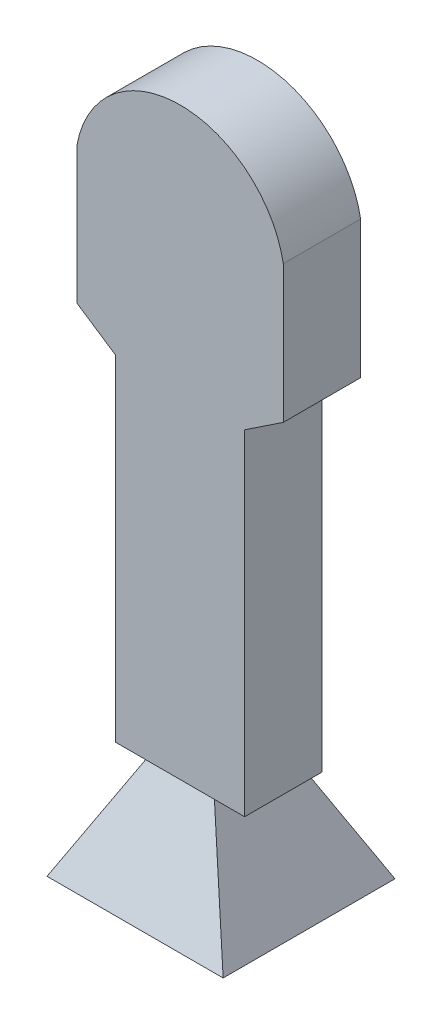
ISO-10303-21;
HEADER;
FILE_DESCRIPTION(('STEP AP214'),'2;1');
FILE_NAME('part.step','',(''),(''),'','','');
FILE_SCHEMA(('AUTOMOTIVE_DESIGN { 1 0 10303 214 1 1 1 1 }'));
ENDSEC;
DATA;
#1=APPLICATION_CONTEXT('core data for automotive mechanical design processes');
#2=APPLICATION_PROTOCOL_DEFINITION('international standard','automotive_design',2000,#1);
#3=PRODUCT_CONTEXT('',#1,'mechanical');
#4=PRODUCT('Part','Part','',(#3));
#5=PRODUCT_RELATED_PRODUCT_CATEGORY('part','',(#4));
#6=PRODUCT_DEFINITION_FORMATION('','',#4);
#7=PRODUCT_DEFINITION_CONTEXT('part definition',#1,'design');
#8=PRODUCT_DEFINITION('design','',#6,#7);
#9=PRODUCT_DEFINITION_SHAPE('','',#8);
#10=(LENGTH_UNIT() NAMED_UNIT(*) SI_UNIT(.MILLI.,.METRE.));
#11=(NAMED_UNIT(*) PLANE_ANGLE_UNIT() SI_UNIT($,.RADIAN.));
#12=(NAMED_UNIT(*) SI_UNIT($,.STERADIAN.) SOLID_ANGLE_UNIT());
#13=UNCERTAINTY_MEASURE_WITH_UNIT(LENGTH_MEASURE(1.E-05),#10,'distance_accuracy_value','');
#14=(GEOMETRIC_REPRESENTATION_CONTEXT(3) GLOBAL_UNCERTAINTY_ASSIGNED_CONTEXT((#13)) GLOBAL_UNIT_ASSIGNED_CONTEXT((#10,
#11,#12)) REPRESENTATION_CONTEXT('',''));
#15=CARTESIAN_POINT('',(0.,0.,0.));
#16=DIRECTION('',(0.,0.,1.));
#17=DIRECTION('',(1.,0.,0.));
#18=AXIS2_PLACEMENT_3D('',#15,#16,#17);
#19=CARTESIAN_POINT('',(-10.,-57.,4.5));
#20=DIRECTION('',(0.,1.,0.));
#21=DIRECTION('',(0.,0.,1.));
#22=AXIS2_PLACEMENT_3D('',#19,#20,#21);
#23=PLANE('',#22);
#24=DIRECTION('',(0.,0.,1.));
#25=VECTOR('',#24,1.);
#26=CARTESIAN_POINT('',(-3.,-57.,3.5));
#27=LINE('',#26,#25);
#28=CARTESIAN_POINT('',(-3.,-57.,-3.5));
#29=VERTEX_POINT('',#28);
#30=CARTESIAN_POINT('',(-3.,-57.,3.5));
#31=VERTEX_POINT('',#30);
#32=EDGE_CURVE('E383',#29,#31,#27,.T.);
#33=ORIENTED_EDGE('',*,*,#32,.T.);
#34=DIRECTION('',(1.,0.,0.));
#35=VECTOR('',#34,1.);
#36=CARTESIAN_POINT('',(0.,-57.,3.5));
#37=LINE('',#36,#35);
#38=CARTESIAN_POINT('',(3.,-57.,3.5));
#39=VERTEX_POINT('',#38);
#40=EDGE_CURVE('E381',#31,#39,#37,.T.);
#41=ORIENTED_EDGE('',*,*,#40,.T.);
#42=DIRECTION('',(0.,0.,-1.));
#43=VECTOR('',#42,1.);
#44=CARTESIAN_POINT('',(3.,-57.,3.5));
#45=LINE('',#44,#43);
#46=CARTESIAN_POINT('',(3.,-57.,-3.5));
#47=VERTEX_POINT('',#46);
#48=EDGE_CURVE('E385',#39,#47,#45,.T.);
#49=ORIENTED_EDGE('',*,*,#48,.T.);
#50=DIRECTION('',(1.,0.,0.));
#51=VECTOR('',#50,1.);
#52=CARTESIAN_POINT('',(0.,-57.,-3.5));
#53=LINE('',#52,#51);
#54=EDGE_CURVE('E220',#29,#47,#53,.T.);
#55=ORIENTED_EDGE('',*,*,#54,.F.);
#56=EDGE_LOOP('',(#33,#41,#49,#55));
#57=FACE_BOUND('',#56,.T.);
#58=DIRECTION('',(1.,0.,0.));
#59=VECTOR('',#58,1.);
#60=CARTESIAN_POINT('',(-10.,-57.,-1.66283647761011));
#61=LINE('',#60,#59);
#62=CARTESIAN_POINT('',(-1.51061217973868,-57.,-1.66283647761011));
#63=VERTEX_POINT('',#62);
#64=CARTESIAN_POINT('',(1.51061217973868,-57.,-1.66283647761011));
#65=VERTEX_POINT('',#64);
#66=EDGE_CURVE('E215',#63,#65,#61,.T.);
#67=ORIENTED_EDGE('',*,*,#66,.T.);
#68=DIRECTION('',(0.,0.,1.));
#69=VECTOR('',#68,1.);
#70=CARTESIAN_POINT('',(1.51061217973868,-57.,4.5));
#71=LINE('',#70,#69);
#72=CARTESIAN_POINT('',(1.51061217973868,-57.,1.66283647761011));
#73=VERTEX_POINT('',#72);
#74=EDGE_CURVE('E11',#65,#73,#71,.T.);
#75=ORIENTED_EDGE('',*,*,#74,.T.);
#76=DIRECTION('',(-1.,0.,0.));
#77=VECTOR('',#76,1.);
#78=CARTESIAN_POINT('',(-10.,-57.,1.66283647761011));
#79=LINE('',#78,#77);
#80=CARTESIAN_POINT('',(-1.51061217973868,-57.,1.66283647761011));
#81=VERTEX_POINT('',#80);
#82=EDGE_CURVE('E41',#73,#81,#79,.T.);
#83=ORIENTED_EDGE('',*,*,#82,.T.);
#84=DIRECTION('',(0.,0.,-1.));
#85=VECTOR('',#84,1.);
#86=CARTESIAN_POINT('',(-1.51061217973868,-57.,4.5));
#87=LINE('',#86,#85);
#88=EDGE_CURVE('E219',#81,#63,#87,.T.);
#89=ORIENTED_EDGE('',*,*,#88,.T.);
#90=EDGE_LOOP('',(#67,#75,#83,#89));
#91=FACE_BOUND('',#90,.T.);
#92=ADVANCED_FACE('F33',(#57,#91),#23,.T.);
#93=CARTESIAN_POINT('',(-11.,-14.,3.5));
#94=DIRECTION('',(0.571637687854966,0.820506157090749,0.));
#95=DIRECTION('',(-0.820506157090749,0.571637687854966,0.));
#96=AXIS2_PLACEMENT_3D('',#93,#94,#95);
#97=PLANE('',#96);
#98=DIRECTION('',(0.,0.,-1.));
#99=VECTOR('',#98,1.);
#100=CARTESIAN_POINT('',(-11.,-14.,3.5));
#101=LINE('',#100,#99);
#102=CARTESIAN_POINT('',(-11.,-14.,3.5));
#103=VERTEX_POINT('',#102);
#104=CARTESIAN_POINT('',(-11.,-14.,-3.5));
#105=VERTEX_POINT('',#104);
#106=EDGE_CURVE('E323',#103,#105,#101,.T.);
#107=ORIENTED_EDGE('',*,*,#106,.F.);
#108=DIRECTION('',(0.820506157090749,-0.571637687854966,0.));
#109=VECTOR('',#108,1.);
#110=CARTESIAN_POINT('',(-11.,-14.,3.5));
#111=LINE('',#110,#109);
#112=CARTESIAN_POINT('',(-6.5,-17.1351009046271,3.5));
#113=VERTEX_POINT('',#112);
#114=EDGE_CURVE('E346',#103,#113,#111,.T.);
#115=ORIENTED_EDGE('',*,*,#114,.T.);
#116=DIRECTION('',(0.,0.,-1.));
#117=VECTOR('',#116,1.);
#118=CARTESIAN_POINT('',(-6.5,-17.1351009046271,3.5));
#119=LINE('',#118,#117);
#120=CARTESIAN_POINT('',(-6.5,-17.1351009046271,-3.5));
#121=VERTEX_POINT('',#120);
#122=EDGE_CURVE('E304',#113,#121,#119,.T.);
#123=ORIENTED_EDGE('',*,*,#122,.T.);
#124=DIRECTION('',(0.820506157090749,-0.571637687854966,0.));
#125=VECTOR('',#124,1.);
#126=CARTESIAN_POINT('',(-11.,-14.,-3.5));
#127=LINE('',#126,#125);
#128=EDGE_CURVE('E378',#105,#121,#127,.T.);
#129=ORIENTED_EDGE('',*,*,#128,.F.);
#130=EDGE_LOOP('',(#107,#115,#123,#129));
#131=FACE_BOUND('',#130,.T.);
#132=ADVANCED_FACE('F453',(#131),#97,.T.);
#133=CARTESIAN_POINT('',(-6.5,-56.1094421952284,3.5));
#134=DIRECTION('',(1.,0.,0.));
#135=DIRECTION('',(0.,0.,-1.));
#136=AXIS2_PLACEMENT_3D('',#133,#134,#135);
#137=PLANE('',#136);
#138=ORIENTED_EDGE('',*,*,#122,.F.);
#139=DIRECTION('',(0.,-1.,0.));
#140=VECTOR('',#139,1.);
#141=CARTESIAN_POINT('',(-6.5,-56.1094421952284,3.5));
#142=LINE('',#141,#140);
#143=CARTESIAN_POINT('',(-6.5,-56.1094421952284,3.5));
#144=VERTEX_POINT('',#143);
#145=EDGE_CURVE('E344',#113,#144,#142,.T.);
#146=ORIENTED_EDGE('',*,*,#145,.T.);
#147=DIRECTION('',(0.,0.,-1.));
#148=VECTOR('',#147,1.);
#149=CARTESIAN_POINT('',(-6.5,-56.1094421952284,3.5));
#150=LINE('',#149,#148);
#151=CARTESIAN_POINT('',(-6.5,-56.1094421952284,-3.5));
#152=VERTEX_POINT('',#151);
#153=EDGE_CURVE('E306',#144,#152,#150,.T.);
#154=ORIENTED_EDGE('',*,*,#153,.T.);
#155=DIRECTION('',(0.,-1.,0.));
#156=VECTOR('',#155,1.);
#157=CARTESIAN_POINT('',(-6.5,-56.1094421952284,-3.5));
#158=LINE('',#157,#156);
#159=EDGE_CURVE('E375',#121,#152,#158,.T.);
#160=ORIENTED_EDGE('',*,*,#159,.F.);
#161=EDGE_LOOP('',(#138,#146,#154,#160));
#162=FACE_BOUND('',#161,.T.);
#163=ADVANCED_FACE('F460',(#162),#137,.T.);
#164=CARTESIAN_POINT('',(-6.5,-56.1094421952284,3.5));
#165=DIRECTION('',(0.,1.,0.));
#166=DIRECTION('',(0.,0.,1.));
#167=AXIS2_PLACEMENT_3D('',#164,#165,#166);
#168=PLANE('',#167);
#169=ORIENTED_EDGE('',*,*,#153,.F.);
#170=DIRECTION('',(1.,0.,0.));
#171=VECTOR('',#170,1.);
#172=CARTESIAN_POINT('',(-6.5,-56.1094421952284,3.5));
#173=LINE('',#172,#171);
#174=CARTESIAN_POINT('',(-3.,-56.1094421952284,3.5));
#175=VERTEX_POINT('',#174);
#176=EDGE_CURVE('E342',#144,#175,#173,.T.);
#177=ORIENTED_EDGE('',*,*,#176,.T.);
#178=DIRECTION('',(0.,0.,-1.));
#179=VECTOR('',#178,1.);
#180=CARTESIAN_POINT('',(-3.,-56.1094421952284,3.5));
#181=LINE('',#180,#179);
#182=CARTESIAN_POINT('',(-3.,-56.1094421952284,-3.5));
#183=VERTEX_POINT('',#182);
#184=EDGE_CURVE('E308',#175,#183,#181,.T.);
#185=ORIENTED_EDGE('',*,*,#184,.T.);
#186=DIRECTION('',(1.,0.,0.));
#187=VECTOR('',#186,1.);
#188=CARTESIAN_POINT('',(-6.5,-56.1094421952284,-3.5));
#189=LINE('',#188,#187);
#190=EDGE_CURVE('E372',#152,#183,#189,.T.);
#191=ORIENTED_EDGE('',*,*,#190,.F.);
#192=EDGE_LOOP('',(#169,#177,#185,#191));
#193=FACE_BOUND('',#192,.T.);
#194=ADVANCED_FACE('F505',(#193),#168,.T.);
#195=CARTESIAN_POINT('',(-3.,-57.0637363629491,3.5));
#196=DIRECTION('',(1.,0.,0.));
#197=DIRECTION('',(0.,0.,-1.));
#198=AXIS2_PLACEMENT_3D('',#195,#196,#197);
#199=PLANE('',#198);
#200=ORIENTED_EDGE('',*,*,#32,.F.);
#201=DIRECTION('',(0.,-1.,0.));
#202=VECTOR('',#201,1.);
#203=CARTESIAN_POINT('',(-3.,-57.0637363629491,-3.5));
#204=LINE('',#203,#202);
#205=EDGE_CURVE('E369',#183,#29,#204,.T.);
#206=ORIENTED_EDGE('',*,*,#205,.F.);
#207=ORIENTED_EDGE('',*,*,#184,.F.);
#208=DIRECTION('',(0.,-1.,0.));
#209=VECTOR('',#208,1.);
#210=CARTESIAN_POINT('',(-3.,-57.0637363629491,3.5));
#211=LINE('',#210,#209);
#212=EDGE_CURVE('E339',#175,#31,#211,.T.);
#213=ORIENTED_EDGE('',*,*,#212,.T.);
#214=EDGE_LOOP('',(#200,#206,#207,#213));
#215=FACE_BOUND('',#214,.T.);
#216=ADVANCED_FACE('F501',(#215),#199,.T.);
#217=CARTESIAN_POINT('',(3.,-57.0637363629491,3.5));
#218=DIRECTION('',(-1.,0.,0.));
#219=DIRECTION('',(0.,-1.,0.));
#220=AXIS2_PLACEMENT_3D('',#217,#218,#219);
#221=PLANE('',#220);
#222=ORIENTED_EDGE('',*,*,#48,.F.);
#223=DIRECTION('',(0.,1.,0.));
#224=VECTOR('',#223,1.);
#225=CARTESIAN_POINT('',(3.,-57.0637363629491,3.5));
#226=LINE('',#225,#224);
#227=CARTESIAN_POINT('',(3.,-56.1094421952284,3.5));
#228=VERTEX_POINT('',#227);
#229=EDGE_CURVE('E337',#39,#228,#226,.T.);
#230=ORIENTED_EDGE('',*,*,#229,.T.);
#231=DIRECTION('',(0.,0.,-1.));
#232=VECTOR('',#231,1.);
#233=CARTESIAN_POINT('',(3.,-56.1094421952284,3.5));
#234=LINE('',#233,#232);
#235=CARTESIAN_POINT('',(3.,-56.1094421952284,-3.5));
#236=VERTEX_POINT('',#235);
#237=EDGE_CURVE('E310',#228,#236,#234,.T.);
#238=ORIENTED_EDGE('',*,*,#237,.T.);
#239=DIRECTION('',(0.,1.,0.));
#240=VECTOR('',#239,1.);
#241=CARTESIAN_POINT('',(3.,-57.0637363629491,-3.5));
#242=LINE('',#241,#240);
#243=EDGE_CURVE('E367',#47,#236,#242,.T.);
#244=ORIENTED_EDGE('',*,*,#243,.F.);
#245=EDGE_LOOP('',(#222,#230,#238,#244));
#246=FACE_BOUND('',#245,.T.);
#247=ADVANCED_FACE('F497',(#246),#221,.T.);
#248=CARTESIAN_POINT('',(3.,-56.1094421952284,3.5));
#249=DIRECTION('',(0.,1.,0.));
#250=DIRECTION('',(0.,0.,1.));
#251=AXIS2_PLACEMENT_3D('',#248,#249,#250);
#252=PLANE('',#251);
#253=ORIENTED_EDGE('',*,*,#237,.F.);
#254=DIRECTION('',(1.,0.,0.));
#255=VECTOR('',#254,1.);
#256=CARTESIAN_POINT('',(3.,-56.1094421952284,3.5));
#257=LINE('',#256,#255);
#258=CARTESIAN_POINT('',(6.5,-56.1094421952284,3.5));
#259=VERTEX_POINT('',#258);
#260=EDGE_CURVE('E335',#228,#259,#257,.T.);
#261=ORIENTED_EDGE('',*,*,#260,.T.);
#262=DIRECTION('',(0.,0.,-1.));
#263=VECTOR('',#262,1.);
#264=CARTESIAN_POINT('',(6.5,-56.1094421952284,3.5));
#265=LINE('',#264,#263);
#266=CARTESIAN_POINT('',(6.5,-56.1094421952284,-3.5));
#267=VERTEX_POINT('',#266);
#268=EDGE_CURVE('E313',#259,#267,#265,.T.);
#269=ORIENTED_EDGE('',*,*,#268,.T.);
#270=DIRECTION('',(1.,0.,0.));
#271=VECTOR('',#270,1.);
#272=CARTESIAN_POINT('',(3.,-56.1094421952284,-3.5));
#273=LINE('',#272,#271);
#274=EDGE_CURVE('E364',#236,#267,#273,.T.);
#275=ORIENTED_EDGE('',*,*,#274,.F.);
#276=EDGE_LOOP('',(#253,#261,#269,#275));
#277=FACE_BOUND('',#276,.T.);
#278=ADVANCED_FACE('F493',(#277),#252,.T.);
#279=CARTESIAN_POINT('',(6.5,-56.1094421952284,3.5));
#280=DIRECTION('',(-1.,0.,0.));
#281=DIRECTION('',(0.,0.,1.));
#282=AXIS2_PLACEMENT_3D('',#279,#280,#281);
#283=PLANE('',#282);
#284=ORIENTED_EDGE('',*,*,#268,.F.);
#285=DIRECTION('',(0.,1.,0.));
#286=VECTOR('',#285,1.);
#287=CARTESIAN_POINT('',(6.5,-56.1094421952284,3.5));
#288=LINE('',#287,#286);
#289=CARTESIAN_POINT('',(6.5,-17.1351009046271,3.5));
#290=VERTEX_POINT('',#289);
#291=EDGE_CURVE('E333',#259,#290,#288,.T.);
#292=ORIENTED_EDGE('',*,*,#291,.T.);
#293=DIRECTION('',(0.,0.,-1.));
#294=VECTOR('',#293,1.);
#295=CARTESIAN_POINT('',(6.5,-17.1351009046271,3.5));
#296=LINE('',#295,#294);
#297=CARTESIAN_POINT('',(6.5,-17.1351009046271,-3.5));
#298=VERTEX_POINT('',#297);
#299=EDGE_CURVE('E315',#290,#298,#296,.T.);
#300=ORIENTED_EDGE('',*,*,#299,.T.);
#301=DIRECTION('',(0.,1.,0.));
#302=VECTOR('',#301,1.);
#303=CARTESIAN_POINT('',(6.5,-56.1094421952284,-3.5));
#304=LINE('',#303,#302);
#305=EDGE_CURVE('E361',#267,#298,#304,.T.);
#306=ORIENTED_EDGE('',*,*,#305,.F.);
#307=EDGE_LOOP('',(#284,#292,#300,#306));
#308=FACE_BOUND('',#307,.T.);
#309=ADVANCED_FACE('F489',(#308),#283,.T.);
#310=CARTESIAN_POINT('',(11.,-14.,3.5));
#311=DIRECTION('',(-0.571637687854965,0.82050615709075,0.));
#312=DIRECTION('',(-0.82050615709075,-0.571637687854965,0.));
#313=AXIS2_PLACEMENT_3D('',#310,#311,#312);
#314=PLANE('',#313);
#315=ORIENTED_EDGE('',*,*,#299,.F.);
#316=DIRECTION('',(0.82050615709075,0.571637687854965,0.));
#317=VECTOR('',#316,1.);
#318=CARTESIAN_POINT('',(11.,-14.,3.5));
#319=LINE('',#318,#317);
#320=CARTESIAN_POINT('',(11.,-14.,3.5));
#321=VERTEX_POINT('',#320);
#322=EDGE_CURVE('E331',#290,#321,#319,.T.);
#323=ORIENTED_EDGE('',*,*,#322,.T.);
#324=DIRECTION('',(0.,0.,-1.));
#325=VECTOR('',#324,1.);
#326=CARTESIAN_POINT('',(11.,-14.,3.5));
#327=LINE('',#326,#325);
#328=CARTESIAN_POINT('',(11.,-14.,-3.5));
#329=VERTEX_POINT('',#328);
#330=EDGE_CURVE('E317',#321,#329,#327,.T.);
#331=ORIENTED_EDGE('',*,*,#330,.T.);
#332=DIRECTION('',(0.82050615709075,0.571637687854965,0.));
#333=VECTOR('',#332,1.);
#334=CARTESIAN_POINT('',(11.,-14.,-3.5));
#335=LINE('',#334,#333);
#336=EDGE_CURVE('E358',#298,#329,#335,.T.);
#337=ORIENTED_EDGE('',*,*,#336,.F.);
#338=EDGE_LOOP('',(#315,#323,#331,#337));
#339=FACE_BOUND('',#338,.T.);
#340=ADVANCED_FACE('F485',(#339),#314,.T.);
#341=CARTESIAN_POINT('',(11.,0.,3.5));
#342=DIRECTION('',(-1.,0.,0.));
#343=DIRECTION('',(0.,0.,1.));
#344=AXIS2_PLACEMENT_3D('',#341,#342,#343);
#345=PLANE('',#344);
#346=ORIENTED_EDGE('',*,*,#330,.F.);
#347=DIRECTION('',(0.,1.,0.));
#348=VECTOR('',#347,1.);
#349=CARTESIAN_POINT('',(11.,0.,3.5));
#350=LINE('',#349,#348);
#351=CARTESIAN_POINT('',(11.,0.,3.5));
#352=VERTEX_POINT('',#351);
#353=EDGE_CURVE('E329',#321,#352,#350,.T.);
#354=ORIENTED_EDGE('',*,*,#353,.T.);
#355=DIRECTION('',(0.,0.,-1.));
#356=VECTOR('',#355,1.);
#357=CARTESIAN_POINT('',(11.,0.,3.5));
#358=LINE('',#357,#356);
#359=CARTESIAN_POINT('',(11.,0.,-3.5));
#360=VERTEX_POINT('',#359);
#361=EDGE_CURVE('E319',#352,#360,#358,.T.);
#362=ORIENTED_EDGE('',*,*,#361,.T.);
#363=DIRECTION('',(0.,1.,0.));
#364=VECTOR('',#363,1.);
#365=CARTESIAN_POINT('',(11.,0.,-3.5));
#366=LINE('',#365,#364);
#367=EDGE_CURVE('E355',#329,#360,#366,.T.);
#368=ORIENTED_EDGE('',*,*,#367,.F.);
#369=EDGE_LOOP('',(#346,#354,#362,#368));
#370=FACE_BOUND('',#369,.T.);
#371=ADVANCED_FACE('F481',(#370),#345,.T.);
#372=CARTESIAN_POINT('',(0.,-1.07636111892482,3.5));
#373=DIRECTION('',(0.,0.,-1.));
#374=DIRECTION('',(-1.,0.,0.));
#375=AXIS2_PLACEMENT_3D('',#372,#373,#374);
#376=CYLINDRICAL_SURFACE('',#375,11.0525360555093);
#377=ORIENTED_EDGE('',*,*,#361,.F.);
#378=CARTESIAN_POINT('',(0.,-1.07636111892482,3.5));
#379=DIRECTION('',(0.,0.,1.));
#380=DIRECTION('',(-1.,0.,0.));
#381=AXIS2_PLACEMENT_3D('',#378,#379,#380);
#382=CIRCLE('',#381,11.0525360555093);
#383=CARTESIAN_POINT('',(-11.,0.,3.5));
#384=VERTEX_POINT('',#383);
#385=EDGE_CURVE('E327',#352,#384,#382,.T.);
#386=ORIENTED_EDGE('',*,*,#385,.T.);
#387=DIRECTION('',(0.,0.,-1.));
#388=VECTOR('',#387,1.);
#389=CARTESIAN_POINT('',(-11.,0.,3.5));
#390=LINE('',#389,#388);
#391=CARTESIAN_POINT('',(-11.,0.,-3.5));
#392=VERTEX_POINT('',#391);
#393=EDGE_CURVE('E321',#384,#392,#390,.T.);
#394=ORIENTED_EDGE('',*,*,#393,.T.);
#395=CARTESIAN_POINT('',(0.,-1.07636111892482,-3.5));
#396=DIRECTION('',(0.,0.,1.));
#397=DIRECTION('',(-1.,0.,0.));
#398=AXIS2_PLACEMENT_3D('',#395,#396,#397);
#399=CIRCLE('',#398,11.0525360555093);
#400=EDGE_CURVE('E352',#360,#392,#399,.T.);
#401=ORIENTED_EDGE('',*,*,#400,.F.);
#402=EDGE_LOOP('',(#377,#386,#394,#401));
#403=FACE_BOUND('',#402,.T.);
#404=ADVANCED_FACE('F477',(#403),#376,.F.);
#405=CARTESIAN_POINT('',(-11.,0.,3.5));
#406=DIRECTION('',(1.,0.,0.));
#407=DIRECTION('',(0.,1.,0.));
#408=AXIS2_PLACEMENT_3D('',#405,#406,#407);
#409=PLANE('',#408);
#410=ORIENTED_EDGE('',*,*,#393,.F.);
#411=DIRECTION('',(0.,-1.,0.));
#412=VECTOR('',#411,1.);
#413=CARTESIAN_POINT('',(-11.,0.,3.5));
#414=LINE('',#413,#412);
#415=EDGE_CURVE('E325',#384,#103,#414,.T.);
#416=ORIENTED_EDGE('',*,*,#415,.T.);
#417=ORIENTED_EDGE('',*,*,#106,.T.);
#418=DIRECTION('',(0.,-1.,0.));
#419=VECTOR('',#418,1.);
#420=CARTESIAN_POINT('',(-11.,0.,-3.5));
#421=LINE('',#420,#419);
#422=EDGE_CURVE('E349',#392,#105,#421,.T.);
#423=ORIENTED_EDGE('',*,*,#422,.F.);
#424=EDGE_LOOP('',(#410,#416,#417,#423));
#425=FACE_BOUND('',#424,.T.);
#426=ADVANCED_FACE('F473',(#425),#409,.T.);
#427=CARTESIAN_POINT('',(0.,-1.07636111892482,3.5));
#428=DIRECTION('',(0.,0.,-1.));
#429=DIRECTION('',(-1.,0.,0.));
#430=AXIS2_PLACEMENT_3D('',#427,#428,#429);
#431=PLANE('',#430);
#432=ORIENTED_EDGE('',*,*,#40,.F.);
#433=ORIENTED_EDGE('',*,*,#212,.F.);
#434=ORIENTED_EDGE('',*,*,#176,.F.);
#435=ORIENTED_EDGE('',*,*,#145,.F.);
#436=ORIENTED_EDGE('',*,*,#114,.F.);
#437=ORIENTED_EDGE('',*,*,#415,.F.);
#438=ORIENTED_EDGE('',*,*,#385,.F.);
#439=ORIENTED_EDGE('',*,*,#353,.F.);
#440=ORIENTED_EDGE('',*,*,#322,.F.);
#441=ORIENTED_EDGE('',*,*,#291,.F.);
#442=ORIENTED_EDGE('',*,*,#260,.F.);
#443=ORIENTED_EDGE('',*,*,#229,.F.);
#444=EDGE_LOOP('',(#432,#433,#434,#435,#436,#437,#438,#439,#440,#441,#442,#443));
#445=FACE_BOUND('',#444,.T.);
#446=ADVANCED_FACE('F448',(#445),#431,.T.);
#447=CARTESIAN_POINT('',(0.,-1.07636111892482,-3.5));
#448=DIRECTION('',(0.,0.,-1.));
#449=DIRECTION('',(-1.,0.,0.));
#450=AXIS2_PLACEMENT_3D('',#447,#448,#449);
#451=PLANE('',#450);
#452=ORIENTED_EDGE('',*,*,#205,.T.);
#453=ORIENTED_EDGE('',*,*,#54,.T.);
#454=ORIENTED_EDGE('',*,*,#243,.T.);
#455=ORIENTED_EDGE('',*,*,#274,.T.);
#456=ORIENTED_EDGE('',*,*,#305,.T.);
#457=ORIENTED_EDGE('',*,*,#336,.T.);
#458=ORIENTED_EDGE('',*,*,#367,.T.);
#459=ORIENTED_EDGE('',*,*,#400,.T.);
#460=ORIENTED_EDGE('',*,*,#422,.T.);
#461=ORIENTED_EDGE('',*,*,#128,.T.);
#462=ORIENTED_EDGE('',*,*,#159,.T.);
#463=ORIENTED_EDGE('',*,*,#190,.T.);
#464=EDGE_LOOP('',(#452,#453,#454,#455,#456,#457,#458,#459,#460,#461,#462,#463));
#465=FACE_BOUND('',#464,.T.);
#466=ADVANCED_FACE('F440',(#465),#451,.F.);
#467=CARTESIAN_POINT('',(1.51061217973868,-86.,-1.66283647761011));
#468=DIRECTION('',(-1.,0.,0.));
#469=DIRECTION('',(0.,0.,1.));
#470=AXIS2_PLACEMENT_3D('',#467,#468,#469);
#471=PLANE('',#470);
#472=DIRECTION('',(0.,1.,0.));
#473=VECTOR('',#472,1.);
#474=CARTESIAN_POINT('',(1.51061217973868,-86.,1.66283647761011));
#475=LINE('',#474,#473);
#476=CARTESIAN_POINT('',(1.51061217973868,-69.,1.66283647761011));
#477=VERTEX_POINT('',#476);
#478=EDGE_CURVE('E428',#477,#73,#475,.T.);
#479=ORIENTED_EDGE('',*,*,#478,.T.);
#480=ORIENTED_EDGE('',*,*,#74,.F.);
#481=DIRECTION('',(0.,1.,0.));
#482=VECTOR('',#481,1.);
#483=CARTESIAN_POINT('',(1.51061217973868,-86.,-1.66283647761011));
#484=LINE('',#483,#482);
#485=CARTESIAN_POINT('',(1.51061217973868,-69.,-1.66283647761011));
#486=VERTEX_POINT('',#485);
#487=EDGE_CURVE('E53',#486,#65,#484,.T.);
#488=ORIENTED_EDGE('',*,*,#487,.F.);
#489=DIRECTION('',(0.,0.,-1.));
#490=VECTOR('',#489,1.);
#491=CARTESIAN_POINT('',(1.51061217973868,-69.,-4.5));
#492=LINE('',#491,#490);
#493=EDGE_CURVE('E417',#477,#486,#492,.T.);
#494=ORIENTED_EDGE('',*,*,#493,.F.);
#495=EDGE_LOOP('',(#479,#480,#488,#494));
#496=FACE_BOUND('',#495,.T.);
#497=ADVANCED_FACE('F438',(#496),#471,.T.);
#498=CARTESIAN_POINT('',(-1.51061217973868,-86.,1.66283647761011));
#499=DIRECTION('',(0.,0.,-1.));
#500=DIRECTION('',(-1.,0.,0.));
#501=AXIS2_PLACEMENT_3D('',#498,#499,#500);
#502=PLANE('',#501);
#503=DIRECTION('',(0.,1.,0.));
#504=VECTOR('',#503,1.);
#505=CARTESIAN_POINT('',(-1.51061217973868,-86.,1.66283647761011));
#506=LINE('',#505,#504);
#507=CARTESIAN_POINT('',(-1.51061217973868,-69.,1.66283647761011));
#508=VERTEX_POINT('',#507);
#509=EDGE_CURVE('E229',#508,#81,#506,.T.);
#510=ORIENTED_EDGE('',*,*,#509,.T.);
#511=ORIENTED_EDGE('',*,*,#82,.F.);
#512=ORIENTED_EDGE('',*,*,#478,.F.);
#513=DIRECTION('',(1.,0.,0.));
#514=VECTOR('',#513,1.);
#515=CARTESIAN_POINT('',(-10.,-69.,1.66283647761011));
#516=LINE('',#515,#514);
#517=EDGE_CURVE('E422',#508,#477,#516,.T.);
#518=ORIENTED_EDGE('',*,*,#517,.F.);
#519=EDGE_LOOP('',(#510,#511,#512,#518));
#520=FACE_BOUND('',#519,.T.);
#521=ADVANCED_FACE('F433',(#520),#502,.T.);
#522=CARTESIAN_POINT('',(-1.51061217973868,-86.,-1.66283647761011));
#523=DIRECTION('',(1.,0.,0.));
#524=DIRECTION('',(0.,0.,-1.));
#525=AXIS2_PLACEMENT_3D('',#522,#523,#524);
#526=PLANE('',#525);
#527=DIRECTION('',(0.,1.,0.));
#528=VECTOR('',#527,1.);
#529=CARTESIAN_POINT('',(-1.51061217973868,-86.,-1.66283647761011));
#530=LINE('',#529,#528);
#531=CARTESIAN_POINT('',(-1.51061217973868,-69.,-1.66283647761011));
#532=VERTEX_POINT('',#531);
#533=EDGE_CURVE('E48',#532,#63,#530,.T.);
#534=ORIENTED_EDGE('',*,*,#533,.T.);
#535=ORIENTED_EDGE('',*,*,#88,.F.);
#536=ORIENTED_EDGE('',*,*,#509,.F.);
#537=DIRECTION('',(0.,0.,1.));
#538=VECTOR('',#537,1.);
#539=CARTESIAN_POINT('',(-1.51061217973868,-69.,-4.5));
#540=LINE('',#539,#538);
#541=EDGE_CURVE('E227',#532,#508,#540,.T.);
#542=ORIENTED_EDGE('',*,*,#541,.F.);
#543=EDGE_LOOP('',(#534,#535,#536,#542));
#544=FACE_BOUND('',#543,.T.);
#545=ADVANCED_FACE('F223',(#544),#526,.T.);
#546=CARTESIAN_POINT('',(-1.51061217973868,-86.,-1.66283647761011));
#547=DIRECTION('',(0.,0.,1.));
#548=DIRECTION('',(1.,0.,0.));
#549=AXIS2_PLACEMENT_3D('',#546,#547,#548);
#550=PLANE('',#549);
#551=ORIENTED_EDGE('',*,*,#487,.T.);
#552=ORIENTED_EDGE('',*,*,#66,.F.);
#553=ORIENTED_EDGE('',*,*,#533,.F.);
#554=DIRECTION('',(-1.,0.,0.));
#555=VECTOR('',#554,1.);
#556=CARTESIAN_POINT('',(-10.,-69.,-1.66283647761011));
#557=LINE('',#556,#555);
#558=EDGE_CURVE('E426',#486,#532,#557,.T.);
#559=ORIENTED_EDGE('',*,*,#558,.F.);
#560=EDGE_LOOP('',(#551,#552,#553,#559));
#561=FACE_BOUND('',#560,.T.);
#562=ADVANCED_FACE('F216',(#561),#550,.T.);
#563=CARTESIAN_POINT('',(-10.,-69.,-4.5));
#564=DIRECTION('',(0.,-1.,0.));
#565=DIRECTION('',(0.,0.,-1.));
#566=AXIS2_PLACEMENT_3D('',#563,#564,#565);
#567=PLANE('',#566);
#568=DIRECTION('',(0.,0.,1.));
#569=VECTOR('',#568,1.);
#570=CARTESIAN_POINT('',(-10.,-69.,-4.5));
#571=LINE('',#570,#569);
#572=CARTESIAN_POINT('',(-10.,-69.,-10.));
#573=VERTEX_POINT('',#572);
#574=CARTESIAN_POINT('',(-10.,-69.,10.));
#575=VERTEX_POINT('',#574);
#576=EDGE_CURVE('E251',#573,#575,#571,.T.);
#577=ORIENTED_EDGE('',*,*,#576,.F.);
#578=DIRECTION('',(1.,0.,0.));
#579=VECTOR('',#578,1.);
#580=CARTESIAN_POINT('',(-10.,-69.,-10.));
#581=LINE('',#580,#579);
#582=CARTESIAN_POINT('',(10.5,-69.,-10.));
#583=VERTEX_POINT('',#582);
#584=EDGE_CURVE('E388',#573,#583,#581,.T.);
#585=ORIENTED_EDGE('',*,*,#584,.T.);
#586=DIRECTION('',(0.,0.,-1.));
#587=VECTOR('',#586,1.);
#588=CARTESIAN_POINT('',(10.5,-69.,0.));
#589=LINE('',#588,#587);
#590=CARTESIAN_POINT('',(10.5,-69.,10.));
#591=VERTEX_POINT('',#590);
#592=EDGE_CURVE('E391',#591,#583,#589,.T.);
#593=ORIENTED_EDGE('',*,*,#592,.F.);
#594=DIRECTION('',(1.,0.,0.));
#595=VECTOR('',#594,1.);
#596=CARTESIAN_POINT('',(-10.,-69.,10.));
#597=LINE('',#596,#595);
#598=EDGE_CURVE('E387',#575,#591,#597,.T.);
#599=ORIENTED_EDGE('',*,*,#598,.F.);
#600=EDGE_LOOP('',(#577,#585,#593,#599));
#601=FACE_BOUND('',#600,.T.);
#602=ORIENTED_EDGE('',*,*,#517,.T.);
#603=ORIENTED_EDGE('',*,*,#493,.T.);
#604=ORIENTED_EDGE('',*,*,#558,.T.);
#605=ORIENTED_EDGE('',*,*,#541,.T.);
#606=EDGE_LOOP('',(#602,#603,#604,#605));
#607=FACE_BOUND('',#606,.T.);
#608=ADVANCED_FACE('F436',(#601,#607),#567,.T.);
#609=CARTESIAN_POINT('',(-10.,-69.,10.));
#610=DIRECTION('',(0.,0.416654710493214,0.909064822894284));
#611=DIRECTION('',(0.,-0.909064822894284,0.416654710493214));
#612=AXIS2_PLACEMENT_3D('',#609,#610,#611);
#613=PLANE('',#612);
#614=ORIENTED_EDGE('',*,*,#598,.T.);
#615=DIRECTION('',(-0.44262522807584,0.81516451825792,-0.373617070868213));
#616=VECTOR('',#615,1.);
#617=CARTESIAN_POINT('',(6.48369960315163,-61.6033461933285,6.60986700527556));
#618=LINE('',#617,#616);
#619=CARTESIAN_POINT('',(3.98413403927193,-57.,4.5));
#620=VERTEX_POINT('',#619);
#621=EDGE_CURVE('E401',#591,#620,#618,.T.);
#622=ORIENTED_EDGE('',*,*,#621,.T.);
#623=DIRECTION('',(1.,0.,0.));
#624=VECTOR('',#623,1.);
#625=CARTESIAN_POINT('',(-7.49999999999999,-57.,4.5));
#626=LINE('',#625,#624);
#627=CARTESIAN_POINT('',(-4.01586596072807,-57.,4.5));
#628=VERTEX_POINT('',#627);
#629=EDGE_CURVE('E285',#628,#620,#626,.T.);
#630=ORIENTED_EDGE('',*,*,#629,.F.);
#631=DIRECTION('',(-0.412885638261243,-0.827960675115113,0.379481976094427));
#632=VECTOR('',#631,1.);
#633=CARTESIAN_POINT('',(-10.,-69.,10.));
#634=LINE('',#633,#632);
#635=EDGE_CURVE('E407',#628,#575,#634,.T.);
#636=ORIENTED_EDGE('',*,*,#635,.T.);
#637=EDGE_LOOP('',(#614,#622,#630,#636));
#638=FACE_BOUND('',#637,.T.);
#639=ADVANCED_FACE('F465',(#638),#613,.T.);
#640=CARTESIAN_POINT('',(-10.,-57.,-4.5));
#641=DIRECTION('',(0.,0.416654710493214,-0.909064822894284));
#642=DIRECTION('',(0.,0.909064822894284,0.416654710493214));
#643=AXIS2_PLACEMENT_3D('',#640,#641,#642);
#644=PLANE('',#643);
#645=DIRECTION('',(1.,0.,0.));
#646=VECTOR('',#645,1.);
#647=CARTESIAN_POINT('',(-7.49999999999999,-57.,-4.5));
#648=LINE('',#647,#646);
#649=CARTESIAN_POINT('',(-4.01586596072807,-57.,-4.5));
#650=VERTEX_POINT('',#649);
#651=CARTESIAN_POINT('',(3.98413403927193,-57.,-4.5));
#652=VERTEX_POINT('',#651);
#653=EDGE_CURVE('E260',#650,#652,#648,.T.);
#654=ORIENTED_EDGE('',*,*,#653,.T.);
#655=DIRECTION('',(0.44262522807584,-0.81516451825792,-0.373617070868213));
#656=VECTOR('',#655,1.);
#657=CARTESIAN_POINT('',(1.24440315675931,-51.9543513036788,-2.1874110141861));
#658=LINE('',#657,#656);
#659=EDGE_CURVE('E404',#652,#583,#658,.T.);
#660=ORIENTED_EDGE('',*,*,#659,.T.);
#661=ORIENTED_EDGE('',*,*,#584,.F.);
#662=DIRECTION('',(0.412885638261243,0.827960675115113,0.379481976094427));
#663=VECTOR('',#662,1.);
#664=CARTESIAN_POINT('',(-5.03600851990252,-59.0456946033887,-5.43761002655317));
#665=LINE('',#664,#663);
#666=EDGE_CURVE('E410',#573,#650,#665,.T.);
#667=ORIENTED_EDGE('',*,*,#666,.T.);
#668=EDGE_LOOP('',(#654,#660,#661,#667));
#669=FACE_BOUND('',#668,.T.);
#670=ADVANCED_FACE('F467',(#669),#644,.T.);
#671=CARTESIAN_POINT('',(12.,-15.,-4.5));
#672=DIRECTION('',(0.554700196225229,-0.832050294337844,0.));
#673=DIRECTION('',(0.832050294337844,0.554700196225229,0.));
#674=AXIS2_PLACEMENT_3D('',#671,#672,#673);
#675=PLANE('',#674);
#676=DIRECTION('',(0.,0.,1.));
#677=VECTOR('',#676,1.);
#678=CARTESIAN_POINT('',(12.,-15.,-4.5));
#679=LINE('',#678,#677);
#680=CARTESIAN_POINT('',(12.,-15.,-4.5));
#681=VERTEX_POINT('',#680);
#682=CARTESIAN_POINT('',(12.,-15.,4.5));
#683=VERTEX_POINT('',#682);
#684=EDGE_CURVE('E237',#681,#683,#679,.T.);
#685=ORIENTED_EDGE('',*,*,#684,.T.);
#686=DIRECTION('',(0.832050294337844,0.554700196225229,0.));
#687=VECTOR('',#686,1.);
#688=CARTESIAN_POINT('',(12.,-15.,4.5));
#689=LINE('',#688,#687);
#690=CARTESIAN_POINT('',(7.5,-18.,4.5));
#691=VERTEX_POINT('',#690);
#692=EDGE_CURVE('E301',#691,#683,#689,.T.);
#693=ORIENTED_EDGE('',*,*,#692,.F.);
#694=DIRECTION('',(0.,0.,1.));
#695=VECTOR('',#694,1.);
#696=CARTESIAN_POINT('',(7.5,-18.,-4.5));
#697=LINE('',#696,#695);
#698=CARTESIAN_POINT('',(7.5,-18.,-4.5));
#699=VERTEX_POINT('',#698);
#700=EDGE_CURVE('E236',#699,#691,#697,.T.);
#701=ORIENTED_EDGE('',*,*,#700,.F.);
#702=DIRECTION('',(0.832050294337844,0.554700196225229,0.));
#703=VECTOR('',#702,1.);
#704=CARTESIAN_POINT('',(12.,-15.,-4.5));
#705=LINE('',#704,#703);
#706=EDGE_CURVE('E276',#699,#681,#705,.T.);
#707=ORIENTED_EDGE('',*,*,#706,.T.);
#708=EDGE_LOOP('',(#685,#693,#701,#707));
#709=FACE_BOUND('',#708,.T.);
#710=ADVANCED_FACE('F35',(#709),#675,.T.);
#711=CARTESIAN_POINT('',(7.5,-57.,-4.5));
#712=DIRECTION('',(1.,0.,0.));
#713=DIRECTION('',(0.,1.,0.));
#714=AXIS2_PLACEMENT_3D('',#711,#712,#713);
#715=PLANE('',#714);
#716=ORIENTED_EDGE('',*,*,#700,.T.);
#717=DIRECTION('',(0.,1.,0.));
#718=VECTOR('',#717,1.);
#719=CARTESIAN_POINT('',(7.5,-57.,4.5));
#720=LINE('',#719,#718);
#721=CARTESIAN_POINT('',(7.5,-57.,4.5));
#722=VERTEX_POINT('',#721);
#723=EDGE_CURVE('E279',#722,#691,#720,.T.);
#724=ORIENTED_EDGE('',*,*,#723,.F.);
#725=DIRECTION('',(0.,0.,1.));
#726=VECTOR('',#725,1.);
#727=CARTESIAN_POINT('',(7.5,-57.,-4.5));
#728=LINE('',#727,#726);
#729=CARTESIAN_POINT('',(7.5,-57.,-4.5));
#730=VERTEX_POINT('',#729);
#731=EDGE_CURVE('E253',#730,#722,#728,.T.);
#732=ORIENTED_EDGE('',*,*,#731,.F.);
#733=DIRECTION('',(0.,1.,0.));
#734=VECTOR('',#733,1.);
#735=CARTESIAN_POINT('',(7.5,-57.,-4.5));
#736=LINE('',#735,#734);
#737=EDGE_CURVE('E240',#730,#699,#736,.T.);
#738=ORIENTED_EDGE('',*,*,#737,.T.);
#739=EDGE_LOOP('',(#716,#724,#732,#738));
#740=FACE_BOUND('',#739,.T.);
#741=ADVANCED_FACE('F523',(#740),#715,.T.);
#742=CARTESIAN_POINT('',(-7.5,-18.,-4.5));
#743=DIRECTION('',(-1.,0.,0.));
#744=DIRECTION('',(0.,-1.,0.));
#745=AXIS2_PLACEMENT_3D('',#742,#743,#744);
#746=PLANE('',#745);
#747=DIRECTION('',(0.,0.,1.));
#748=VECTOR('',#747,1.);
#749=CARTESIAN_POINT('',(-7.49999999999999,-57.,-4.5));
#750=LINE('',#749,#748);
#751=CARTESIAN_POINT('',(-7.49999999999999,-57.,-4.5));
#752=VERTEX_POINT('',#751);
#753=CARTESIAN_POINT('',(-7.49999999999999,-57.,4.5));
#754=VERTEX_POINT('',#753);
#755=EDGE_CURVE('E248',#752,#754,#750,.T.);
#756=ORIENTED_EDGE('',*,*,#755,.T.);
#757=DIRECTION('',(0.,-1.,0.));
#758=VECTOR('',#757,1.);
#759=CARTESIAN_POINT('',(-7.5,-18.,4.5));
#760=LINE('',#759,#758);
#761=CARTESIAN_POINT('',(-7.5,-18.,4.5));
#762=VERTEX_POINT('',#761);
#763=EDGE_CURVE('E286',#762,#754,#760,.T.);
#764=ORIENTED_EDGE('',*,*,#763,.F.);
#765=DIRECTION('',(0.,0.,1.));
#766=VECTOR('',#765,1.);
#767=CARTESIAN_POINT('',(-7.5,-18.,-4.5));
#768=LINE('',#767,#766);
#769=CARTESIAN_POINT('',(-7.5,-18.,-4.5));
#770=VERTEX_POINT('',#769);
#771=EDGE_CURVE('E246',#770,#762,#768,.T.);
#772=ORIENTED_EDGE('',*,*,#771,.F.);
#773=DIRECTION('',(0.,-1.,0.));
#774=VECTOR('',#773,1.);
#775=CARTESIAN_POINT('',(-7.5,-18.,-4.5));
#776=LINE('',#775,#774);
#777=EDGE_CURVE('E261',#770,#752,#776,.T.);
#778=ORIENTED_EDGE('',*,*,#777,.T.);
#779=EDGE_LOOP('',(#756,#764,#772,#778));
#780=FACE_BOUND('',#779,.T.);
#781=ADVANCED_FACE('F526',(#780),#746,.T.);
#782=CARTESIAN_POINT('',(-12.,-15.,-4.5));
#783=DIRECTION('',(-0.554700196225229,-0.832050294337844,0.));
#784=DIRECTION('',(0.832050294337844,-0.554700196225229,0.));
#785=AXIS2_PLACEMENT_3D('',#782,#783,#784);
#786=PLANE('',#785);
#787=ORIENTED_EDGE('',*,*,#771,.T.);
#788=DIRECTION('',(0.832050294337844,-0.554700196225229,0.));
#789=VECTOR('',#788,1.);
#790=CARTESIAN_POINT('',(-12.,-15.,4.5));
#791=LINE('',#790,#789);
#792=CARTESIAN_POINT('',(-12.,-15.,4.5));
#793=VERTEX_POINT('',#792);
#794=EDGE_CURVE('E289',#793,#762,#791,.T.);
#795=ORIENTED_EDGE('',*,*,#794,.F.);
#796=DIRECTION('',(0.,0.,1.));
#797=VECTOR('',#796,1.);
#798=CARTESIAN_POINT('',(-12.,-15.,-4.5));
#799=LINE('',#798,#797);
#800=CARTESIAN_POINT('',(-12.,-15.,-4.5));
#801=VERTEX_POINT('',#800);
#802=EDGE_CURVE('E244',#801,#793,#799,.T.);
#803=ORIENTED_EDGE('',*,*,#802,.F.);
#804=DIRECTION('',(0.832050294337844,-0.554700196225229,0.));
#805=VECTOR('',#804,1.);
#806=CARTESIAN_POINT('',(-12.,-15.,-4.5));
#807=LINE('',#806,#805);
#808=EDGE_CURVE('E264',#801,#770,#807,.T.);
#809=ORIENTED_EDGE('',*,*,#808,.T.);
#810=EDGE_LOOP('',(#787,#795,#803,#809));
#811=FACE_BOUND('',#810,.T.);
#812=ADVANCED_FACE('F533',(#811),#786,.T.);
#813=CARTESIAN_POINT('',(-12.,0.999999999999997,-4.5));
#814=DIRECTION('',(-1.,0.,0.));
#815=DIRECTION('',(0.,-1.,0.));
#816=AXIS2_PLACEMENT_3D('',#813,#814,#815);
#817=PLANE('',#816);
#818=ORIENTED_EDGE('',*,*,#802,.T.);
#819=DIRECTION('',(0.,-1.,0.));
#820=VECTOR('',#819,1.);
#821=CARTESIAN_POINT('',(-12.,0.999999999999997,4.5));
#822=LINE('',#821,#820);
#823=CARTESIAN_POINT('',(-12.,0.999999999999997,4.5));
#824=VERTEX_POINT('',#823);
#825=EDGE_CURVE('E292',#824,#793,#822,.T.);
#826=ORIENTED_EDGE('',*,*,#825,.F.);
#827=DIRECTION('',(0.,0.,1.));
#828=VECTOR('',#827,1.);
#829=CARTESIAN_POINT('',(-12.,0.999999999999997,-4.5));
#830=LINE('',#829,#828);
#831=CARTESIAN_POINT('',(-12.,0.999999999999997,-4.5));
#832=VERTEX_POINT('',#831);
#833=EDGE_CURVE('E242',#832,#824,#830,.T.);
#834=ORIENTED_EDGE('',*,*,#833,.F.);
#835=DIRECTION('',(0.,-1.,0.));
#836=VECTOR('',#835,1.);
#837=CARTESIAN_POINT('',(-12.,0.999999999999997,-4.5));
#838=LINE('',#837,#836);
#839=EDGE_CURVE('E267',#832,#801,#838,.T.);
#840=ORIENTED_EDGE('',*,*,#839,.T.);
#841=EDGE_LOOP('',(#818,#826,#834,#840));
#842=FACE_BOUND('',#841,.T.);
#843=ADVANCED_FACE('F537',(#842),#817,.T.);
#844=CARTESIAN_POINT('',(0.,-1.21106770024911,-4.5));
#845=DIRECTION('',(0.,0.,1.));
#846=DIRECTION('',(1.,0.,0.));
#847=AXIS2_PLACEMENT_3D('',#844,#845,#846);
#848=CYLINDRICAL_SURFACE('',#847,12.202000671);
#849=ORIENTED_EDGE('',*,*,#833,.T.);
#850=CARTESIAN_POINT('',(0.,-1.21106770024911,4.5));
#851=DIRECTION('',(0.,0.,1.));
#852=DIRECTION('',(-1.,0.,0.));
#853=AXIS2_PLACEMENT_3D('',#850,#851,#852);
#854=CIRCLE('',#853,12.202000671);
#855=CARTESIAN_POINT('',(12.,1.,4.5));
#856=VERTEX_POINT('',#855);
#857=EDGE_CURVE('E295',#856,#824,#854,.T.);
#858=ORIENTED_EDGE('',*,*,#857,.F.);
#859=DIRECTION('',(0.,0.,1.));
#860=VECTOR('',#859,1.);
#861=CARTESIAN_POINT('',(12.,1.,-4.5));
#862=LINE('',#861,#860);
#863=CARTESIAN_POINT('',(12.,1.,-4.5));
#864=VERTEX_POINT('',#863);
#865=EDGE_CURVE('E239',#864,#856,#862,.T.);
#866=ORIENTED_EDGE('',*,*,#865,.F.);
#867=CARTESIAN_POINT('',(0.,-1.21106770024911,-4.5));
#868=DIRECTION('',(0.,0.,1.));
#869=DIRECTION('',(-1.,0.,0.));
#870=AXIS2_PLACEMENT_3D('',#867,#868,#869);
#871=CIRCLE('',#870,12.202000671);
#872=EDGE_CURVE('E270',#864,#832,#871,.T.);
#873=ORIENTED_EDGE('',*,*,#872,.T.);
#874=EDGE_LOOP('',(#849,#858,#866,#873));
#875=FACE_BOUND('',#874,.T.);
#876=ADVANCED_FACE('F541',(#875),#848,.T.);
#877=CARTESIAN_POINT('',(12.,1.,-4.5));
#878=DIRECTION('',(1.,0.,0.));
#879=DIRECTION('',(0.,1.,0.));
#880=AXIS2_PLACEMENT_3D('',#877,#878,#879);
#881=PLANE('',#880);
#882=ORIENTED_EDGE('',*,*,#865,.T.);
#883=DIRECTION('',(0.,1.,0.));
#884=VECTOR('',#883,1.);
#885=CARTESIAN_POINT('',(12.,1.,4.5));
#886=LINE('',#885,#884);
#887=EDGE_CURVE('E298',#683,#856,#886,.T.);
#888=ORIENTED_EDGE('',*,*,#887,.F.);
#889=ORIENTED_EDGE('',*,*,#684,.F.);
#890=DIRECTION('',(0.,1.,0.));
#891=VECTOR('',#890,1.);
#892=CARTESIAN_POINT('',(12.,1.,-4.5));
#893=LINE('',#892,#891);
#894=EDGE_CURVE('E273',#681,#864,#893,.T.);
#895=ORIENTED_EDGE('',*,*,#894,.T.);
#896=EDGE_LOOP('',(#882,#888,#889,#895));
#897=FACE_BOUND('',#896,.T.);
#898=ADVANCED_FACE('F521',(#897),#881,.T.);
#899=CARTESIAN_POINT('',(0.,-1.21106770024911,-4.5));
#900=DIRECTION('',(0.,0.,-1.));
#901=DIRECTION('',(-1.,0.,0.));
#902=AXIS2_PLACEMENT_3D('',#899,#900,#901);
#903=PLANE('',#902);
#904=ORIENTED_EDGE('',*,*,#737,.F.);
#905=DIRECTION('',(-1.,0.,0.));
#906=VECTOR('',#905,1.);
#907=CARTESIAN_POINT('',(-10.,-57.,-4.5));
#908=LINE('',#907,#906);
#909=EDGE_CURVE('E398',#730,#652,#908,.T.);
#910=ORIENTED_EDGE('',*,*,#909,.T.);
#911=ORIENTED_EDGE('',*,*,#653,.F.);
#912=EDGE_CURVE('E258',#752,#650,#648,.T.);
#913=ORIENTED_EDGE('',*,*,#912,.F.);
#914=ORIENTED_EDGE('',*,*,#777,.F.);
#915=ORIENTED_EDGE('',*,*,#808,.F.);
#916=ORIENTED_EDGE('',*,*,#839,.F.);
#917=ORIENTED_EDGE('',*,*,#872,.F.);
#918=ORIENTED_EDGE('',*,*,#894,.F.);
#919=ORIENTED_EDGE('',*,*,#706,.F.);
#920=EDGE_LOOP('',(#904,#910,#911,#913,#914,#915,#916,#917,#918,#919));
#921=FACE_BOUND('',#920,.T.);
#922=ADVANCED_FACE('F517',(#921),#903,.T.);
#923=CARTESIAN_POINT('',(0.,-1.21106770024911,4.5));
#924=DIRECTION('',(0.,0.,-1.));
#925=DIRECTION('',(-1.,0.,0.));
#926=AXIS2_PLACEMENT_3D('',#923,#924,#925);
#927=PLANE('',#926);
#928=EDGE_CURVE('E282',#754,#628,#626,.T.);
#929=ORIENTED_EDGE('',*,*,#928,.T.);
#930=ORIENTED_EDGE('',*,*,#629,.T.);
#931=DIRECTION('',(1.,0.,0.));
#932=VECTOR('',#931,1.);
#933=CARTESIAN_POINT('',(-10.,-57.,4.5));
#934=LINE('',#933,#932);
#935=EDGE_CURVE('E395',#620,#722,#934,.T.);
#936=ORIENTED_EDGE('',*,*,#935,.T.);
#937=ORIENTED_EDGE('',*,*,#723,.T.);
#938=ORIENTED_EDGE('',*,*,#692,.T.);
#939=ORIENTED_EDGE('',*,*,#887,.T.);
#940=ORIENTED_EDGE('',*,*,#857,.T.);
#941=ORIENTED_EDGE('',*,*,#825,.T.);
#942=ORIENTED_EDGE('',*,*,#794,.T.);
#943=ORIENTED_EDGE('',*,*,#763,.T.);
#944=EDGE_LOOP('',(#929,#930,#936,#937,#938,#939,#940,#941,#942,#943));
#945=FACE_BOUND('',#944,.T.);
#946=ADVANCED_FACE('F513',(#945),#927,.F.);
#947=CARTESIAN_POINT('',(-10.,-57.,20.));
#948=DIRECTION('',(0.,-1.,0.));
#949=DIRECTION('',(0.,0.,-1.));
#950=AXIS2_PLACEMENT_3D('',#947,#948,#949);
#951=PLANE('',#950);
#952=ORIENTED_EDGE('',*,*,#755,.F.);
#953=ORIENTED_EDGE('',*,*,#912,.T.);
#954=DIRECTION('',(0.,0.,-1.));
#955=VECTOR('',#954,1.);
#956=CARTESIAN_POINT('',(-4.01586596072807,-57.,20.));
#957=LINE('',#956,#955);
#958=EDGE_CURVE('E414',#628,#650,#957,.T.);
#959=ORIENTED_EDGE('',*,*,#958,.F.);
#960=ORIENTED_EDGE('',*,*,#928,.F.);
#961=EDGE_LOOP('',(#952,#953,#959,#960));
#962=FACE_BOUND('',#961,.T.);
#963=ADVANCED_FACE('F516',(#962),#951,.T.);
#964=CARTESIAN_POINT('',(-4.01586596072807,-57.,20.));
#965=DIRECTION('',(-0.894899971724249,0.446266781878214,0.));
#966=DIRECTION('',(-0.446266781878214,-0.894899971724249,0.));
#967=AXIS2_PLACEMENT_3D('',#964,#965,#966);
#968=PLANE('',#967);
#969=ORIENTED_EDGE('',*,*,#958,.T.);
#970=ORIENTED_EDGE('',*,*,#666,.F.);
#971=ORIENTED_EDGE('',*,*,#576,.T.);
#972=ORIENTED_EDGE('',*,*,#635,.F.);
#973=EDGE_LOOP('',(#969,#970,#971,#972));
#974=FACE_BOUND('',#973,.T.);
#975=ADVANCED_FACE('F570',(#974),#968,.T.);
#976=CARTESIAN_POINT('',(10.5,-57.,20.));
#977=DIRECTION('',(0.,-1.,0.));
#978=DIRECTION('',(0.,0.,-1.));
#979=AXIS2_PLACEMENT_3D('',#976,#977,#978);
#980=PLANE('',#979);
#981=DIRECTION('',(0.,0.,-1.));
#982=VECTOR('',#981,1.);
#983=CARTESIAN_POINT('',(3.98413403927193,-57.,20.));
#984=LINE('',#983,#982);
#985=EDGE_CURVE('E413',#620,#652,#984,.T.);
#986=ORIENTED_EDGE('',*,*,#985,.T.);
#987=ORIENTED_EDGE('',*,*,#909,.F.);
#988=ORIENTED_EDGE('',*,*,#731,.T.);
#989=ORIENTED_EDGE('',*,*,#935,.F.);
#990=EDGE_LOOP('',(#986,#987,#988,#989));
#991=FACE_BOUND('',#990,.T.);
#992=ADVANCED_FACE('F718',(#991),#980,.T.);
#993=CARTESIAN_POINT('',(3.98413403927193,-57.,20.));
#994=DIRECTION('',(0.878804903353059,0.47718124632326,0.));
#995=DIRECTION('',(-0.47718124632326,0.878804903353059,0.));
#996=AXIS2_PLACEMENT_3D('',#993,#994,#995);
#997=PLANE('',#996);
#998=ORIENTED_EDGE('',*,*,#592,.T.);
#999=ORIENTED_EDGE('',*,*,#659,.F.);
#1000=ORIENTED_EDGE('',*,*,#985,.F.);
#1001=ORIENTED_EDGE('',*,*,#621,.F.);
#1002=EDGE_LOOP('',(#998,#999,#1000,#1001));
#1003=FACE_BOUND('',#1002,.T.);
#1004=ADVANCED_FACE('F726',(#1003),#997,.T.);
#1005=CLOSED_SHELL('',(#92,#132,#163,#194,#216,#247,#278,#309,#340,#371,#404,#426,#446,#466,
#497,#521,#545,#562,#608,#639,#670,#710,#741,#781,#812,#843,#876,#898,#922,#946,#963,#975,#992,#1004));
#1006=MANIFOLD_SOLID_BREP('B2',#1005);
#1007=ADVANCED_BREP_SHAPE_REPRESENTATION('',(#18,#1006),#14);
#1008=SHAPE_DEFINITION_REPRESENTATION(#9,#1007);
ENDSEC;
END-ISO-10303-21;
